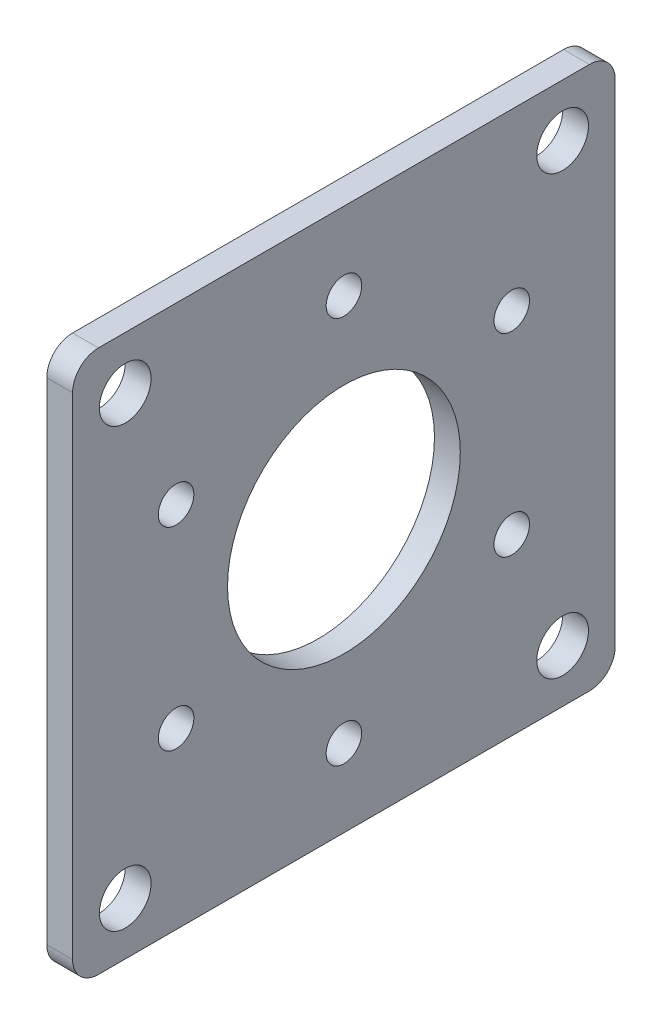
ISO-10303-21;
HEADER;
FILE_DESCRIPTION(('STEP AP214'),'2;1');
FILE_NAME('part.step','',(''),(''),'','','');
FILE_SCHEMA(('AUTOMOTIVE_DESIGN { 1 0 10303 214 1 1 1 1 }'));
ENDSEC;
DATA;
#1=APPLICATION_CONTEXT('core data for automotive mechanical design processes');
#2=APPLICATION_PROTOCOL_DEFINITION('international standard','automotive_design',2000,#1);
#3=PRODUCT_CONTEXT('',#1,'mechanical');
#4=PRODUCT('Part','Part','',(#3));
#5=PRODUCT_RELATED_PRODUCT_CATEGORY('part','',(#4));
#6=PRODUCT_DEFINITION_FORMATION('','',#4);
#7=PRODUCT_DEFINITION_CONTEXT('part definition',#1,'design');
#8=PRODUCT_DEFINITION('design','',#6,#7);
#9=PRODUCT_DEFINITION_SHAPE('','',#8);
#10=(LENGTH_UNIT() NAMED_UNIT(*) SI_UNIT(.MILLI.,.METRE.));
#11=(NAMED_UNIT(*) PLANE_ANGLE_UNIT() SI_UNIT($,.RADIAN.));
#12=(NAMED_UNIT(*) SI_UNIT($,.STERADIAN.) SOLID_ANGLE_UNIT());
#13=UNCERTAINTY_MEASURE_WITH_UNIT(LENGTH_MEASURE(1.E-05),#10,'distance_accuracy_value','');
#14=(GEOMETRIC_REPRESENTATION_CONTEXT(3) GLOBAL_UNCERTAINTY_ASSIGNED_CONTEXT((#13)) GLOBAL_UNIT_ASSIGNED_CONTEXT((#10,
#11,#12)) REPRESENTATION_CONTEXT('',''));
#15=CARTESIAN_POINT('',(0.,0.,0.));
#16=DIRECTION('',(0.,0.,1.));
#17=DIRECTION('',(1.,0.,0.));
#18=AXIS2_PLACEMENT_3D('',#15,#16,#17);
#19=CARTESIAN_POINT('',(3.175,0.,0.));
#20=DIRECTION('',(1.,0.,0.));
#21=DIRECTION('',(0.,0.,-1.));
#22=AXIS2_PLACEMENT_3D('',#19,#20,#21);
#23=PLANE('',#22);
#24=CARTESIAN_POINT('',(3.175,-11.90625,20.6222299276169));
#25=DIRECTION('',(1.,0.,0.));
#26=DIRECTION('',(0.,0.,-1.));
#27=AXIS2_PLACEMENT_3D('',#24,#25,#26);
#28=CIRCLE('',#27,2.1828125);
#29=CARTESIAN_POINT('',(3.175,-11.90625,18.4394174276169));
#30=VERTEX_POINT('',#29);
#31=EDGE_CURVE('E230',#30,#30,#28,.T.);
#32=ORIENTED_EDGE('',*,*,#31,.F.);
#33=EDGE_LOOP('',(#32));
#34=FACE_BOUND('',#33,.T.);
#35=CARTESIAN_POINT('',(3.175,-11.90625,-20.6222299276169));
#36=DIRECTION('',(1.,0.,0.));
#37=DIRECTION('',(0.,0.,-1.));
#38=AXIS2_PLACEMENT_3D('',#35,#36,#37);
#39=CIRCLE('',#38,2.1828125);
#40=CARTESIAN_POINT('',(3.175,-11.90625,-22.805042427617));
#41=VERTEX_POINT('',#40);
#42=EDGE_CURVE('E218',#41,#41,#39,.T.);
#43=ORIENTED_EDGE('',*,*,#42,.F.);
#44=EDGE_LOOP('',(#43));
#45=FACE_BOUND('',#44,.T.);
#46=CARTESIAN_POINT('',(3.175,0.,0.));
#47=DIRECTION('',(1.,0.,0.));
#48=DIRECTION('',(0.,0.,-1.));
#49=AXIS2_PLACEMENT_3D('',#46,#47,#48);
#50=CIRCLE('',#49,14.3002);
#51=CARTESIAN_POINT('',(3.175,0.,-14.3002));
#52=VERTEX_POINT('',#51);
#53=EDGE_CURVE('E206',#52,#52,#50,.T.);
#54=ORIENTED_EDGE('',*,*,#53,.F.);
#55=EDGE_LOOP('',(#54));
#56=FACE_BOUND('',#55,.T.);
#57=CARTESIAN_POINT('',(3.175,-26.8700576850888,26.8700576850888));
#58=DIRECTION('',(1.,0.,0.));
#59=DIRECTION('',(0.,0.,-1.));
#60=AXIS2_PLACEMENT_3D('',#57,#58,#59);
#61=CIRCLE('',#60,3.175);
#62=CARTESIAN_POINT('',(3.175,-26.8700576850888,23.6950576850888));
#63=VERTEX_POINT('',#62);
#64=EDGE_CURVE('E194',#63,#63,#61,.T.);
#65=ORIENTED_EDGE('',*,*,#64,.F.);
#66=EDGE_LOOP('',(#65));
#67=FACE_BOUND('',#66,.T.);
#68=CARTESIAN_POINT('',(3.175,26.8700576850888,-26.8700576850888));
#69=DIRECTION('',(1.,0.,0.));
#70=DIRECTION('',(0.,0.,-1.));
#71=AXIS2_PLACEMENT_3D('',#68,#69,#70);
#72=CIRCLE('',#71,3.175);
#73=CARTESIAN_POINT('',(3.175,26.8700576850888,-30.0450576850888));
#74=VERTEX_POINT('',#73);
#75=EDGE_CURVE('E182',#74,#74,#72,.T.);
#76=ORIENTED_EDGE('',*,*,#75,.F.);
#77=EDGE_LOOP('',(#76));
#78=FACE_BOUND('',#77,.T.);
#79=DIRECTION('',(0.,1.,0.));
#80=VECTOR('',#79,1.);
#81=CARTESIAN_POINT('',(3.175,33.3375,-33.3375));
#82=LINE('',#81,#80);
#83=CARTESIAN_POINT('',(3.175,-30.1625,-33.3375));
#84=VERTEX_POINT('',#83);
#85=CARTESIAN_POINT('',(3.175,30.1625,-33.3375));
#86=VERTEX_POINT('',#85);
#87=EDGE_CURVE('E139',#84,#86,#82,.T.);
#88=ORIENTED_EDGE('',*,*,#87,.T.);
#89=CARTESIAN_POINT('',(3.175,30.1625,-30.1625));
#90=DIRECTION('',(1.,0.,0.));
#91=DIRECTION('',(0.,0.,-1.));
#92=AXIS2_PLACEMENT_3D('',#89,#90,#91);
#93=CIRCLE('',#92,3.175);
#94=CARTESIAN_POINT('',(3.175,33.3375,-30.1625));
#95=VERTEX_POINT('',#94);
#96=EDGE_CURVE('E154',#86,#95,#93,.T.);
#97=ORIENTED_EDGE('',*,*,#96,.T.);
#98=DIRECTION('',(0.,0.,1.));
#99=VECTOR('',#98,1.);
#100=CARTESIAN_POINT('',(3.175,33.3375,33.3375));
#101=LINE('',#100,#99);
#102=CARTESIAN_POINT('',(3.175,33.3375,30.1625));
#103=VERTEX_POINT('',#102);
#104=EDGE_CURVE('E121',#95,#103,#101,.T.);
#105=ORIENTED_EDGE('',*,*,#104,.T.);
#106=CARTESIAN_POINT('',(3.175,30.1625,30.1625));
#107=DIRECTION('',(1.,0.,0.));
#108=DIRECTION('',(0.,0.,-1.));
#109=AXIS2_PLACEMENT_3D('',#106,#107,#108);
#110=CIRCLE('',#109,3.175);
#111=CARTESIAN_POINT('',(3.175,30.1625,33.3375));
#112=VERTEX_POINT('',#111);
#113=EDGE_CURVE('E149',#103,#112,#110,.T.);
#114=ORIENTED_EDGE('',*,*,#113,.T.);
#115=DIRECTION('',(0.,-1.,0.));
#116=VECTOR('',#115,1.);
#117=CARTESIAN_POINT('',(3.175,33.3375,33.3375));
#118=LINE('',#117,#116);
#119=CARTESIAN_POINT('',(3.175,-30.1625,33.3375));
#120=VERTEX_POINT('',#119);
#121=EDGE_CURVE('E165',#112,#120,#118,.T.);
#122=ORIENTED_EDGE('',*,*,#121,.T.);
#123=CARTESIAN_POINT('',(3.175,-30.1625,30.1625));
#124=DIRECTION('',(1.,0.,0.));
#125=DIRECTION('',(0.,0.,-1.));
#126=AXIS2_PLACEMENT_3D('',#123,#124,#125);
#127=CIRCLE('',#126,3.175);
#128=CARTESIAN_POINT('',(3.175,-33.3375,30.1625));
#129=VERTEX_POINT('',#128);
#130=EDGE_CURVE('E57',#120,#129,#127,.T.);
#131=ORIENTED_EDGE('',*,*,#130,.T.);
#132=DIRECTION('',(0.,0.,-1.));
#133=VECTOR('',#132,1.);
#134=CARTESIAN_POINT('',(3.175,-33.3375,33.3375));
#135=LINE('',#134,#133);
#136=CARTESIAN_POINT('',(3.175,-33.3375,-30.1625));
#137=VERTEX_POINT('',#136);
#138=EDGE_CURVE('E140',#129,#137,#135,.T.);
#139=ORIENTED_EDGE('',*,*,#138,.T.);
#140=CARTESIAN_POINT('',(3.175,-30.1625,-30.1625));
#141=DIRECTION('',(1.,0.,0.));
#142=DIRECTION('',(0.,0.,-1.));
#143=AXIS2_PLACEMENT_3D('',#140,#141,#142);
#144=CIRCLE('',#143,3.175);
#145=EDGE_CURVE('E152',#137,#84,#144,.T.);
#146=ORIENTED_EDGE('',*,*,#145,.T.);
#147=EDGE_LOOP('',(#88,#97,#105,#114,#122,#131,#139,#146));
#148=FACE_BOUND('',#147,.T.);
#149=CARTESIAN_POINT('',(3.175,26.8700576850888,26.8700576850888));
#150=DIRECTION('',(1.,0.,0.));
#151=DIRECTION('',(0.,0.,-1.));
#152=AXIS2_PLACEMENT_3D('',#149,#150,#151);
#153=CIRCLE('',#152,3.175);
#154=CARTESIAN_POINT('',(3.175,26.8700576850888,23.6950576850888));
#155=VERTEX_POINT('',#154);
#156=EDGE_CURVE('E134',#155,#155,#153,.T.);
#157=ORIENTED_EDGE('',*,*,#156,.F.);
#158=EDGE_LOOP('',(#157));
#159=FACE_BOUND('',#158,.T.);
#160=CARTESIAN_POINT('',(3.175,-26.8700576850888,-26.8700576850888));
#161=DIRECTION('',(1.,0.,0.));
#162=DIRECTION('',(0.,0.,-1.));
#163=AXIS2_PLACEMENT_3D('',#160,#161,#162);
#164=CIRCLE('',#163,3.175);
#165=CARTESIAN_POINT('',(3.175,-26.8700576850888,-30.0450576850888));
#166=VERTEX_POINT('',#165);
#167=EDGE_CURVE('E188',#166,#166,#164,.T.);
#168=ORIENTED_EDGE('',*,*,#167,.F.);
#169=EDGE_LOOP('',(#168));
#170=FACE_BOUND('',#169,.T.);
#171=CARTESIAN_POINT('',(3.175,23.8125,0.));
#172=DIRECTION('',(1.,0.,0.));
#173=DIRECTION('',(0.,0.,-1.));
#174=AXIS2_PLACEMENT_3D('',#171,#172,#173);
#175=CIRCLE('',#174,2.1828125);
#176=CARTESIAN_POINT('',(3.175,23.8125,-2.1828125));
#177=VERTEX_POINT('',#176);
#178=EDGE_CURVE('E200',#177,#177,#175,.T.);
#179=ORIENTED_EDGE('',*,*,#178,.F.);
#180=EDGE_LOOP('',(#179));
#181=FACE_BOUND('',#180,.T.);
#182=CARTESIAN_POINT('',(3.175,11.90625,-20.6222299276169));
#183=DIRECTION('',(1.,0.,0.));
#184=DIRECTION('',(0.,0.,-1.));
#185=AXIS2_PLACEMENT_3D('',#182,#183,#184);
#186=CIRCLE('',#185,2.1828125);
#187=CARTESIAN_POINT('',(3.175,11.90625,-22.8050424276169));
#188=VERTEX_POINT('',#187);
#189=EDGE_CURVE('E212',#188,#188,#186,.T.);
#190=ORIENTED_EDGE('',*,*,#189,.F.);
#191=EDGE_LOOP('',(#190));
#192=FACE_BOUND('',#191,.T.);
#193=CARTESIAN_POINT('',(3.175,-23.8125,0.));
#194=DIRECTION('',(1.,0.,0.));
#195=DIRECTION('',(0.,0.,-1.));
#196=AXIS2_PLACEMENT_3D('',#193,#194,#195);
#197=CIRCLE('',#196,2.1828125);
#198=CARTESIAN_POINT('',(3.175,-23.8125,-2.1828125));
#199=VERTEX_POINT('',#198);
#200=EDGE_CURVE('E224',#199,#199,#197,.T.);
#201=ORIENTED_EDGE('',*,*,#200,.F.);
#202=EDGE_LOOP('',(#201));
#203=FACE_BOUND('',#202,.T.);
#204=CARTESIAN_POINT('',(3.175,11.90625,20.6222299276169));
#205=DIRECTION('',(1.,0.,0.));
#206=DIRECTION('',(0.,0.,-1.));
#207=AXIS2_PLACEMENT_3D('',#204,#205,#206);
#208=CIRCLE('',#207,2.1828125);
#209=CARTESIAN_POINT('',(3.175,11.90625,18.4394174276169));
#210=VERTEX_POINT('',#209);
#211=EDGE_CURVE('E236',#210,#210,#208,.T.);
#212=ORIENTED_EDGE('',*,*,#211,.F.);
#213=EDGE_LOOP('',(#212));
#214=FACE_BOUND('',#213,.T.);
#215=ADVANCED_FACE('F35',(#34,#45,#56,#67,#78,#148,#159,#170,#181,#192,#203,#214),#23,.T.);
#216=CARTESIAN_POINT('',(0.,0.,0.));
#217=DIRECTION('',(1.,0.,0.));
#218=DIRECTION('',(0.,0.,-1.));
#219=AXIS2_PLACEMENT_3D('',#216,#217,#218);
#220=PLANE('',#219);
#221=DIRECTION('',(0.,0.,1.));
#222=VECTOR('',#221,1.);
#223=CARTESIAN_POINT('',(0.,33.3375,33.3375));
#224=LINE('',#223,#222);
#225=CARTESIAN_POINT('',(0.,33.3375,-30.1625));
#226=VERTEX_POINT('',#225);
#227=CARTESIAN_POINT('',(0.,33.3375,30.1625));
#228=VERTEX_POINT('',#227);
#229=EDGE_CURVE('E118',#226,#228,#224,.T.);
#230=ORIENTED_EDGE('',*,*,#229,.F.);
#231=CARTESIAN_POINT('',(0.,30.1625,-30.1625));
#232=DIRECTION('',(1.,0.,0.));
#233=DIRECTION('',(0.,0.,-1.));
#234=AXIS2_PLACEMENT_3D('',#231,#232,#233);
#235=CIRCLE('',#234,3.175);
#236=CARTESIAN_POINT('',(0.,30.1625,-33.3375));
#237=VERTEX_POINT('',#236);
#238=EDGE_CURVE('E101',#226,#237,#235,.F.);
#239=ORIENTED_EDGE('',*,*,#238,.T.);
#240=DIRECTION('',(0.,1.,0.));
#241=VECTOR('',#240,1.);
#242=CARTESIAN_POINT('',(0.,33.3375,-33.3375));
#243=LINE('',#242,#241);
#244=CARTESIAN_POINT('',(0.,-30.1625,-33.3375));
#245=VERTEX_POINT('',#244);
#246=EDGE_CURVE('E129',#245,#237,#243,.T.);
#247=ORIENTED_EDGE('',*,*,#246,.F.);
#248=CARTESIAN_POINT('',(0.,-30.1625,-30.1625));
#249=DIRECTION('',(1.,0.,0.));
#250=DIRECTION('',(0.,0.,-1.));
#251=AXIS2_PLACEMENT_3D('',#248,#249,#250);
#252=CIRCLE('',#251,3.175);
#253=CARTESIAN_POINT('',(0.,-33.3375,-30.1625));
#254=VERTEX_POINT('',#253);
#255=EDGE_CURVE('E112',#245,#254,#252,.F.);
#256=ORIENTED_EDGE('',*,*,#255,.T.);
#257=DIRECTION('',(0.,0.,-1.));
#258=VECTOR('',#257,1.);
#259=CARTESIAN_POINT('',(0.,-33.3375,33.3375));
#260=LINE('',#259,#258);
#261=CARTESIAN_POINT('',(0.,-33.3375,30.1625));
#262=VERTEX_POINT('',#261);
#263=EDGE_CURVE('E132',#262,#254,#260,.T.);
#264=ORIENTED_EDGE('',*,*,#263,.F.);
#265=CARTESIAN_POINT('',(0.,-30.1625,30.1625));
#266=DIRECTION('',(1.,0.,0.));
#267=DIRECTION('',(0.,0.,-1.));
#268=AXIS2_PLACEMENT_3D('',#265,#266,#267);
#269=CIRCLE('',#268,3.175);
#270=CARTESIAN_POINT('',(0.,-30.1625,33.3375));
#271=VERTEX_POINT('',#270);
#272=EDGE_CURVE('E143',#262,#271,#269,.F.);
#273=ORIENTED_EDGE('',*,*,#272,.T.);
#274=DIRECTION('',(0.,-1.,0.));
#275=VECTOR('',#274,1.);
#276=CARTESIAN_POINT('',(0.,33.3375,33.3375));
#277=LINE('',#276,#275);
#278=CARTESIAN_POINT('',(0.,30.1625,33.3375));
#279=VERTEX_POINT('',#278);
#280=EDGE_CURVE('E128',#279,#271,#277,.T.);
#281=ORIENTED_EDGE('',*,*,#280,.F.);
#282=CARTESIAN_POINT('',(0.,30.1625,30.1625));
#283=DIRECTION('',(1.,0.,0.));
#284=DIRECTION('',(0.,0.,-1.));
#285=AXIS2_PLACEMENT_3D('',#282,#283,#284);
#286=CIRCLE('',#285,3.175);
#287=EDGE_CURVE('E122',#279,#228,#286,.F.);
#288=ORIENTED_EDGE('',*,*,#287,.T.);
#289=EDGE_LOOP('',(#230,#239,#247,#256,#264,#273,#281,#288));
#290=FACE_BOUND('',#289,.T.);
#291=CARTESIAN_POINT('',(0.,26.8700576850888,26.8700576850888));
#292=DIRECTION('',(1.,0.,0.));
#293=DIRECTION('',(0.,0.,-1.));
#294=AXIS2_PLACEMENT_3D('',#291,#292,#293);
#295=CIRCLE('',#294,3.175);
#296=CARTESIAN_POINT('',(0.,26.8700576850888,23.6950576850888));
#297=VERTEX_POINT('',#296);
#298=EDGE_CURVE('E179',#297,#297,#295,.T.);
#299=ORIENTED_EDGE('',*,*,#298,.T.);
#300=EDGE_LOOP('',(#299));
#301=FACE_BOUND('',#300,.T.);
#302=CARTESIAN_POINT('',(0.,26.8700576850888,-26.8700576850888));
#303=DIRECTION('',(1.,0.,0.));
#304=DIRECTION('',(0.,0.,-1.));
#305=AXIS2_PLACEMENT_3D('',#302,#303,#304);
#306=CIRCLE('',#305,3.175);
#307=CARTESIAN_POINT('',(0.,26.8700576850888,-30.0450576850888));
#308=VERTEX_POINT('',#307);
#309=EDGE_CURVE('E185',#308,#308,#306,.T.);
#310=ORIENTED_EDGE('',*,*,#309,.T.);
#311=EDGE_LOOP('',(#310));
#312=FACE_BOUND('',#311,.T.);
#313=CARTESIAN_POINT('',(0.,-26.8700576850888,-26.8700576850888));
#314=DIRECTION('',(1.,0.,0.));
#315=DIRECTION('',(0.,0.,-1.));
#316=AXIS2_PLACEMENT_3D('',#313,#314,#315);
#317=CIRCLE('',#316,3.175);
#318=CARTESIAN_POINT('',(0.,-26.8700576850888,-30.0450576850888));
#319=VERTEX_POINT('',#318);
#320=EDGE_CURVE('E191',#319,#319,#317,.T.);
#321=ORIENTED_EDGE('',*,*,#320,.T.);
#322=EDGE_LOOP('',(#321));
#323=FACE_BOUND('',#322,.T.);
#324=CARTESIAN_POINT('',(0.,-26.8700576850888,26.8700576850888));
#325=DIRECTION('',(1.,0.,0.));
#326=DIRECTION('',(0.,0.,-1.));
#327=AXIS2_PLACEMENT_3D('',#324,#325,#326);
#328=CIRCLE('',#327,3.175);
#329=CARTESIAN_POINT('',(0.,-26.8700576850888,23.6950576850888));
#330=VERTEX_POINT('',#329);
#331=EDGE_CURVE('E197',#330,#330,#328,.T.);
#332=ORIENTED_EDGE('',*,*,#331,.T.);
#333=EDGE_LOOP('',(#332));
#334=FACE_BOUND('',#333,.T.);
#335=CARTESIAN_POINT('',(0.,23.8125,0.));
#336=DIRECTION('',(1.,0.,0.));
#337=DIRECTION('',(0.,0.,-1.));
#338=AXIS2_PLACEMENT_3D('',#335,#336,#337);
#339=CIRCLE('',#338,2.1828125);
#340=CARTESIAN_POINT('',(0.,23.8125,-2.1828125));
#341=VERTEX_POINT('',#340);
#342=EDGE_CURVE('E203',#341,#341,#339,.T.);
#343=ORIENTED_EDGE('',*,*,#342,.T.);
#344=EDGE_LOOP('',(#343));
#345=FACE_BOUND('',#344,.T.);
#346=CARTESIAN_POINT('',(0.,0.,0.));
#347=DIRECTION('',(1.,0.,0.));
#348=DIRECTION('',(0.,0.,-1.));
#349=AXIS2_PLACEMENT_3D('',#346,#347,#348);
#350=CIRCLE('',#349,14.3002);
#351=CARTESIAN_POINT('',(0.,0.,-14.3002));
#352=VERTEX_POINT('',#351);
#353=EDGE_CURVE('E209',#352,#352,#350,.T.);
#354=ORIENTED_EDGE('',*,*,#353,.T.);
#355=EDGE_LOOP('',(#354));
#356=FACE_BOUND('',#355,.T.);
#357=CARTESIAN_POINT('',(0.,11.90625,-20.6222299276169));
#358=DIRECTION('',(1.,0.,0.));
#359=DIRECTION('',(0.,0.,-1.));
#360=AXIS2_PLACEMENT_3D('',#357,#358,#359);
#361=CIRCLE('',#360,2.1828125);
#362=CARTESIAN_POINT('',(0.,11.90625,-22.8050424276169));
#363=VERTEX_POINT('',#362);
#364=EDGE_CURVE('E215',#363,#363,#361,.T.);
#365=ORIENTED_EDGE('',*,*,#364,.T.);
#366=EDGE_LOOP('',(#365));
#367=FACE_BOUND('',#366,.T.);
#368=CARTESIAN_POINT('',(0.,-11.90625,-20.6222299276169));
#369=DIRECTION('',(1.,0.,0.));
#370=DIRECTION('',(0.,0.,-1.));
#371=AXIS2_PLACEMENT_3D('',#368,#369,#370);
#372=CIRCLE('',#371,2.1828125);
#373=CARTESIAN_POINT('',(0.,-11.90625,-22.805042427617));
#374=VERTEX_POINT('',#373);
#375=EDGE_CURVE('E221',#374,#374,#372,.T.);
#376=ORIENTED_EDGE('',*,*,#375,.T.);
#377=EDGE_LOOP('',(#376));
#378=FACE_BOUND('',#377,.T.);
#379=CARTESIAN_POINT('',(0.,-23.8125,0.));
#380=DIRECTION('',(1.,0.,0.));
#381=DIRECTION('',(0.,0.,-1.));
#382=AXIS2_PLACEMENT_3D('',#379,#380,#381);
#383=CIRCLE('',#382,2.1828125);
#384=CARTESIAN_POINT('',(0.,-23.8125,-2.1828125));
#385=VERTEX_POINT('',#384);
#386=EDGE_CURVE('E227',#385,#385,#383,.T.);
#387=ORIENTED_EDGE('',*,*,#386,.T.);
#388=EDGE_LOOP('',(#387));
#389=FACE_BOUND('',#388,.T.);
#390=CARTESIAN_POINT('',(0.,-11.90625,20.6222299276169));
#391=DIRECTION('',(1.,0.,0.));
#392=DIRECTION('',(0.,0.,-1.));
#393=AXIS2_PLACEMENT_3D('',#390,#391,#392);
#394=CIRCLE('',#393,2.1828125);
#395=CARTESIAN_POINT('',(0.,-11.90625,18.4394174276169));
#396=VERTEX_POINT('',#395);
#397=EDGE_CURVE('E233',#396,#396,#394,.T.);
#398=ORIENTED_EDGE('',*,*,#397,.T.);
#399=EDGE_LOOP('',(#398));
#400=FACE_BOUND('',#399,.T.);
#401=CARTESIAN_POINT('',(0.,11.90625,20.6222299276169));
#402=DIRECTION('',(1.,0.,0.));
#403=DIRECTION('',(0.,0.,-1.));
#404=AXIS2_PLACEMENT_3D('',#401,#402,#403);
#405=CIRCLE('',#404,2.1828125);
#406=CARTESIAN_POINT('',(0.,11.90625,18.4394174276169));
#407=VERTEX_POINT('',#406);
#408=EDGE_CURVE('E239',#407,#407,#405,.T.);
#409=ORIENTED_EDGE('',*,*,#408,.T.);
#410=EDGE_LOOP('',(#409));
#411=FACE_BOUND('',#410,.T.);
#412=ADVANCED_FACE('F125',(#290,#301,#312,#323,#334,#345,#356,#367,#378,#389,#400,#411),#220,.F.);
#413=CARTESIAN_POINT('',(3.175,33.3375,-33.3375));
#414=DIRECTION('',(0.,0.,1.));
#415=DIRECTION('',(0.,-1.,0.));
#416=AXIS2_PLACEMENT_3D('',#413,#414,#415);
#417=PLANE('',#416);
#418=ORIENTED_EDGE('',*,*,#246,.T.);
#419=DIRECTION('',(-1.,0.,0.));
#420=VECTOR('',#419,1.);
#421=CARTESIAN_POINT('',(3.175,30.1625,-33.3375));
#422=LINE('',#421,#420);
#423=EDGE_CURVE('E106',#237,#86,#422,.F.);
#424=ORIENTED_EDGE('',*,*,#423,.T.);
#425=ORIENTED_EDGE('',*,*,#87,.F.);
#426=DIRECTION('',(-1.,0.,0.));
#427=VECTOR('',#426,1.);
#428=CARTESIAN_POINT('',(3.175,-30.1625,-33.3375));
#429=LINE('',#428,#427);
#430=EDGE_CURVE('E111',#84,#245,#429,.T.);
#431=ORIENTED_EDGE('',*,*,#430,.T.);
#432=EDGE_LOOP('',(#418,#424,#425,#431));
#433=FACE_BOUND('',#432,.T.);
#434=ADVANCED_FACE('F254',(#433),#417,.F.);
#435=CARTESIAN_POINT('',(3.175,33.3375,33.3375));
#436=DIRECTION('',(0.,-1.,0.));
#437=DIRECTION('',(0.,0.,-1.));
#438=AXIS2_PLACEMENT_3D('',#435,#436,#437);
#439=PLANE('',#438);
#440=ORIENTED_EDGE('',*,*,#104,.F.);
#441=DIRECTION('',(-1.,0.,0.));
#442=VECTOR('',#441,1.);
#443=CARTESIAN_POINT('',(3.175,33.3375,-30.1625));
#444=LINE('',#443,#442);
#445=EDGE_CURVE('E105',#95,#226,#444,.T.);
#446=ORIENTED_EDGE('',*,*,#445,.T.);
#447=ORIENTED_EDGE('',*,*,#229,.T.);
#448=DIRECTION('',(-1.,0.,0.));
#449=VECTOR('',#448,1.);
#450=CARTESIAN_POINT('',(3.175,33.3375,30.1625));
#451=LINE('',#450,#449);
#452=EDGE_CURVE('E123',#228,#103,#451,.F.);
#453=ORIENTED_EDGE('',*,*,#452,.T.);
#454=EDGE_LOOP('',(#440,#446,#447,#453));
#455=FACE_BOUND('',#454,.T.);
#456=ADVANCED_FACE('F117',(#455),#439,.F.);
#457=CARTESIAN_POINT('',(3.175,33.3375,33.3375));
#458=DIRECTION('',(0.,0.,-1.));
#459=DIRECTION('',(0.,1.,0.));
#460=AXIS2_PLACEMENT_3D('',#457,#458,#459);
#461=PLANE('',#460);
#462=ORIENTED_EDGE('',*,*,#280,.T.);
#463=DIRECTION('',(-1.,0.,0.));
#464=VECTOR('',#463,1.);
#465=CARTESIAN_POINT('',(3.175,-30.1625,33.3375));
#466=LINE('',#465,#464);
#467=EDGE_CURVE('E11',#271,#120,#466,.F.);
#468=ORIENTED_EDGE('',*,*,#467,.T.);
#469=ORIENTED_EDGE('',*,*,#121,.F.);
#470=DIRECTION('',(-1.,0.,0.));
#471=VECTOR('',#470,1.);
#472=CARTESIAN_POINT('',(3.175,30.1625,33.3375));
#473=LINE('',#472,#471);
#474=EDGE_CURVE('E43',#112,#279,#473,.T.);
#475=ORIENTED_EDGE('',*,*,#474,.T.);
#476=EDGE_LOOP('',(#462,#468,#469,#475));
#477=FACE_BOUND('',#476,.T.);
#478=ADVANCED_FACE('F163',(#477),#461,.F.);
#479=CARTESIAN_POINT('',(3.175,-33.3375,33.3375));
#480=DIRECTION('',(0.,1.,0.));
#481=DIRECTION('',(0.,0.,1.));
#482=AXIS2_PLACEMENT_3D('',#479,#480,#481);
#483=PLANE('',#482);
#484=ORIENTED_EDGE('',*,*,#263,.T.);
#485=DIRECTION('',(-1.,0.,0.));
#486=VECTOR('',#485,1.);
#487=CARTESIAN_POINT('',(3.175,-33.3375,-30.1625));
#488=LINE('',#487,#486);
#489=EDGE_CURVE('E50',#254,#137,#488,.F.);
#490=ORIENTED_EDGE('',*,*,#489,.T.);
#491=ORIENTED_EDGE('',*,*,#138,.F.);
#492=DIRECTION('',(-1.,0.,0.));
#493=VECTOR('',#492,1.);
#494=CARTESIAN_POINT('',(3.175,-33.3375,30.1625));
#495=LINE('',#494,#493);
#496=EDGE_CURVE('E156',#129,#262,#495,.T.);
#497=ORIENTED_EDGE('',*,*,#496,.T.);
#498=EDGE_LOOP('',(#484,#490,#491,#497));
#499=FACE_BOUND('',#498,.T.);
#500=ADVANCED_FACE('F172',(#499),#483,.F.);
#501=CARTESIAN_POINT('',(3.175,26.8700576850888,26.8700576850888));
#502=DIRECTION('',(-1.,0.,0.));
#503=DIRECTION('',(0.,0.,1.));
#504=AXIS2_PLACEMENT_3D('',#501,#502,#503);
#505=CYLINDRICAL_SURFACE('',#504,3.175);
#506=ORIENTED_EDGE('',*,*,#156,.T.);
#507=EDGE_LOOP('',(#506));
#508=FACE_BOUND('',#507,.T.);
#509=ORIENTED_EDGE('',*,*,#298,.F.);
#510=EDGE_LOOP('',(#509));
#511=FACE_BOUND('',#510,.T.);
#512=ADVANCED_FACE('F259',(#508,#511),#505,.F.);
#513=CARTESIAN_POINT('',(3.175,26.8700576850888,-26.8700576850888));
#514=DIRECTION('',(-1.,0.,0.));
#515=DIRECTION('',(0.,0.,1.));
#516=AXIS2_PLACEMENT_3D('',#513,#514,#515);
#517=CYLINDRICAL_SURFACE('',#516,3.175);
#518=ORIENTED_EDGE('',*,*,#75,.T.);
#519=EDGE_LOOP('',(#518));
#520=FACE_BOUND('',#519,.T.);
#521=ORIENTED_EDGE('',*,*,#309,.F.);
#522=EDGE_LOOP('',(#521));
#523=FACE_BOUND('',#522,.T.);
#524=ADVANCED_FACE('F336',(#520,#523),#517,.F.);
#525=CARTESIAN_POINT('',(3.175,-26.8700576850888,-26.8700576850888));
#526=DIRECTION('',(-1.,0.,0.));
#527=DIRECTION('',(0.,0.,1.));
#528=AXIS2_PLACEMENT_3D('',#525,#526,#527);
#529=CYLINDRICAL_SURFACE('',#528,3.175);
#530=ORIENTED_EDGE('',*,*,#167,.T.);
#531=EDGE_LOOP('',(#530));
#532=FACE_BOUND('',#531,.T.);
#533=ORIENTED_EDGE('',*,*,#320,.F.);
#534=EDGE_LOOP('',(#533));
#535=FACE_BOUND('',#534,.T.);
#536=ADVANCED_FACE('F333',(#532,#535),#529,.F.);
#537=CARTESIAN_POINT('',(3.175,-26.8700576850888,26.8700576850888));
#538=DIRECTION('',(-1.,0.,0.));
#539=DIRECTION('',(0.,0.,1.));
#540=AXIS2_PLACEMENT_3D('',#537,#538,#539);
#541=CYLINDRICAL_SURFACE('',#540,3.175);
#542=ORIENTED_EDGE('',*,*,#64,.T.);
#543=EDGE_LOOP('',(#542));
#544=FACE_BOUND('',#543,.T.);
#545=ORIENTED_EDGE('',*,*,#331,.F.);
#546=EDGE_LOOP('',(#545));
#547=FACE_BOUND('',#546,.T.);
#548=ADVANCED_FACE('F329',(#544,#547),#541,.F.);
#549=CARTESIAN_POINT('',(3.175,23.8125,0.));
#550=DIRECTION('',(-1.,0.,0.));
#551=DIRECTION('',(0.,0.,1.));
#552=AXIS2_PLACEMENT_3D('',#549,#550,#551);
#553=CYLINDRICAL_SURFACE('',#552,2.1828125);
#554=ORIENTED_EDGE('',*,*,#178,.T.);
#555=EDGE_LOOP('',(#554));
#556=FACE_BOUND('',#555,.T.);
#557=ORIENTED_EDGE('',*,*,#342,.F.);
#558=EDGE_LOOP('',(#557));
#559=FACE_BOUND('',#558,.T.);
#560=ADVANCED_FACE('F325',(#556,#559),#553,.F.);
#561=CARTESIAN_POINT('',(3.175,0.,0.));
#562=DIRECTION('',(-1.,0.,0.));
#563=DIRECTION('',(0.,0.,1.));
#564=AXIS2_PLACEMENT_3D('',#561,#562,#563);
#565=CYLINDRICAL_SURFACE('',#564,14.3002);
#566=ORIENTED_EDGE('',*,*,#53,.T.);
#567=EDGE_LOOP('',(#566));
#568=FACE_BOUND('',#567,.T.);
#569=ORIENTED_EDGE('',*,*,#353,.F.);
#570=EDGE_LOOP('',(#569));
#571=FACE_BOUND('',#570,.T.);
#572=ADVANCED_FACE('F321',(#568,#571),#565,.F.);
#573=CARTESIAN_POINT('',(3.175,11.90625,-20.6222299276169));
#574=DIRECTION('',(-1.,0.,0.));
#575=DIRECTION('',(0.,0.,1.));
#576=AXIS2_PLACEMENT_3D('',#573,#574,#575);
#577=CYLINDRICAL_SURFACE('',#576,2.1828125);
#578=ORIENTED_EDGE('',*,*,#189,.T.);
#579=EDGE_LOOP('',(#578));
#580=FACE_BOUND('',#579,.T.);
#581=ORIENTED_EDGE('',*,*,#364,.F.);
#582=EDGE_LOOP('',(#581));
#583=FACE_BOUND('',#582,.T.);
#584=ADVANCED_FACE('F317',(#580,#583),#577,.F.);
#585=CARTESIAN_POINT('',(3.175,-11.90625,-20.6222299276169));
#586=DIRECTION('',(-1.,0.,0.));
#587=DIRECTION('',(0.,0.,1.));
#588=AXIS2_PLACEMENT_3D('',#585,#586,#587);
#589=CYLINDRICAL_SURFACE('',#588,2.1828125);
#590=ORIENTED_EDGE('',*,*,#42,.T.);
#591=EDGE_LOOP('',(#590));
#592=FACE_BOUND('',#591,.T.);
#593=ORIENTED_EDGE('',*,*,#375,.F.);
#594=EDGE_LOOP('',(#593));
#595=FACE_BOUND('',#594,.T.);
#596=ADVANCED_FACE('F299',(#592,#595),#589,.F.);
#597=CARTESIAN_POINT('',(3.175,-23.8125,0.));
#598=DIRECTION('',(-1.,0.,0.));
#599=DIRECTION('',(0.,0.,1.));
#600=AXIS2_PLACEMENT_3D('',#597,#598,#599);
#601=CYLINDRICAL_SURFACE('',#600,2.1828125);
#602=ORIENTED_EDGE('',*,*,#200,.T.);
#603=EDGE_LOOP('',(#602));
#604=FACE_BOUND('',#603,.T.);
#605=ORIENTED_EDGE('',*,*,#386,.F.);
#606=EDGE_LOOP('',(#605));
#607=FACE_BOUND('',#606,.T.);
#608=ADVANCED_FACE('F295',(#604,#607),#601,.F.);
#609=CARTESIAN_POINT('',(3.175,-11.90625,20.6222299276169));
#610=DIRECTION('',(-1.,0.,0.));
#611=DIRECTION('',(0.,0.,1.));
#612=AXIS2_PLACEMENT_3D('',#609,#610,#611);
#613=CYLINDRICAL_SURFACE('',#612,2.1828125);
#614=ORIENTED_EDGE('',*,*,#31,.T.);
#615=EDGE_LOOP('',(#614));
#616=FACE_BOUND('',#615,.T.);
#617=ORIENTED_EDGE('',*,*,#397,.F.);
#618=EDGE_LOOP('',(#617));
#619=FACE_BOUND('',#618,.T.);
#620=ADVANCED_FACE('F298',(#616,#619),#613,.F.);
#621=CARTESIAN_POINT('',(3.175,11.90625,20.6222299276169));
#622=DIRECTION('',(-1.,0.,0.));
#623=DIRECTION('',(0.,0.,1.));
#624=AXIS2_PLACEMENT_3D('',#621,#622,#623);
#625=CYLINDRICAL_SURFACE('',#624,2.1828125);
#626=ORIENTED_EDGE('',*,*,#211,.T.);
#627=EDGE_LOOP('',(#626));
#628=FACE_BOUND('',#627,.T.);
#629=ORIENTED_EDGE('',*,*,#408,.F.);
#630=EDGE_LOOP('',(#629));
#631=FACE_BOUND('',#630,.T.);
#632=ADVANCED_FACE('F245',(#628,#631),#625,.F.);
#633=CARTESIAN_POINT('',(3.175,30.1625,-30.1625));
#634=DIRECTION('',(-1.,0.,0.));
#635=DIRECTION('',(0.,0.,1.));
#636=AXIS2_PLACEMENT_3D('',#633,#634,#635);
#637=CYLINDRICAL_SURFACE('',#636,3.175);
#638=ORIENTED_EDGE('',*,*,#96,.F.);
#639=ORIENTED_EDGE('',*,*,#423,.F.);
#640=ORIENTED_EDGE('',*,*,#238,.F.);
#641=ORIENTED_EDGE('',*,*,#445,.F.);
#642=EDGE_LOOP('',(#638,#639,#640,#641));
#643=FACE_BOUND('',#642,.T.);
#644=ADVANCED_FACE('F104',(#643),#637,.T.);
#645=CARTESIAN_POINT('',(3.175,-30.1625,-30.1625));
#646=DIRECTION('',(-1.,0.,0.));
#647=DIRECTION('',(0.,0.,1.));
#648=AXIS2_PLACEMENT_3D('',#645,#646,#647);
#649=CYLINDRICAL_SURFACE('',#648,3.175);
#650=ORIENTED_EDGE('',*,*,#145,.F.);
#651=ORIENTED_EDGE('',*,*,#489,.F.);
#652=ORIENTED_EDGE('',*,*,#255,.F.);
#653=ORIENTED_EDGE('',*,*,#430,.F.);
#654=EDGE_LOOP('',(#650,#651,#652,#653));
#655=FACE_BOUND('',#654,.T.);
#656=ADVANCED_FACE('F273',(#655),#649,.T.);
#657=CARTESIAN_POINT('',(3.175,-30.1625,30.1625));
#658=DIRECTION('',(-1.,0.,0.));
#659=DIRECTION('',(0.,0.,1.));
#660=AXIS2_PLACEMENT_3D('',#657,#658,#659);
#661=CYLINDRICAL_SURFACE('',#660,3.175);
#662=ORIENTED_EDGE('',*,*,#130,.F.);
#663=ORIENTED_EDGE('',*,*,#467,.F.);
#664=ORIENTED_EDGE('',*,*,#272,.F.);
#665=ORIENTED_EDGE('',*,*,#496,.F.);
#666=EDGE_LOOP('',(#662,#663,#664,#665));
#667=FACE_BOUND('',#666,.T.);
#668=ADVANCED_FACE('F171',(#667),#661,.T.);
#669=CARTESIAN_POINT('',(3.175,30.1625,30.1625));
#670=DIRECTION('',(-1.,0.,0.));
#671=DIRECTION('',(0.,0.,1.));
#672=AXIS2_PLACEMENT_3D('',#669,#670,#671);
#673=CYLINDRICAL_SURFACE('',#672,3.175);
#674=ORIENTED_EDGE('',*,*,#113,.F.);
#675=ORIENTED_EDGE('',*,*,#452,.F.);
#676=ORIENTED_EDGE('',*,*,#287,.F.);
#677=ORIENTED_EDGE('',*,*,#474,.F.);
#678=EDGE_LOOP('',(#674,#675,#676,#677));
#679=FACE_BOUND('',#678,.T.);
#680=ADVANCED_FACE('F37',(#679),#673,.T.);
#681=CLOSED_SHELL('',(#215,#412,#434,#456,#478,#500,#512,#524,#536,#548,#560,#572,#584,#596,
#608,#620,#632,#644,#656,#668,#680));
#682=MANIFOLD_SOLID_BREP('B2',#681);
#683=ADVANCED_BREP_SHAPE_REPRESENTATION('',(#18,#682),#14);
#684=SHAPE_DEFINITION_REPRESENTATION(#9,#683);
ENDSEC;
END-ISO-10303-21;
